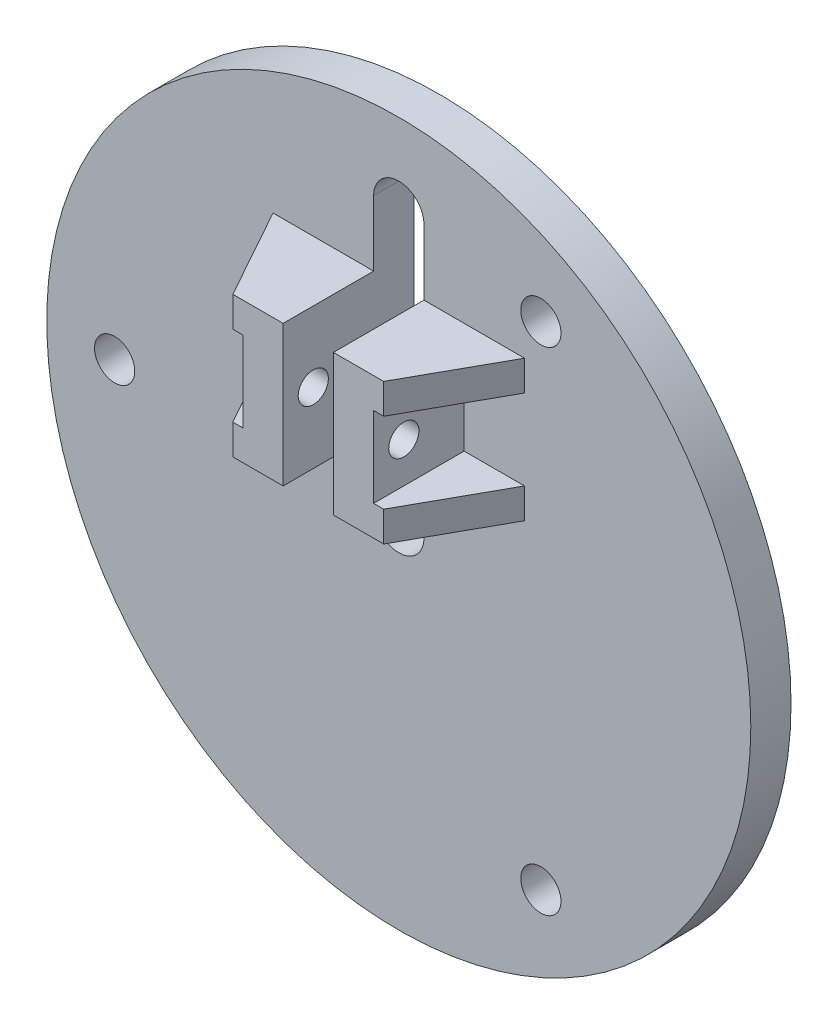
ISO-10303-21;
HEADER;
FILE_DESCRIPTION(('STEP AP214'),'2;1');
FILE_NAME('part.step','',(''),(''),'','','');
FILE_SCHEMA(('AUTOMOTIVE_DESIGN { 1 0 10303 214 1 1 1 1 }'));
ENDSEC;
DATA;
#1=APPLICATION_CONTEXT('core data for automotive mechanical design processes');
#2=APPLICATION_PROTOCOL_DEFINITION('international standard','automotive_design',2000,#1);
#3=PRODUCT_CONTEXT('',#1,'mechanical');
#4=PRODUCT('Part','Part','',(#3));
#5=PRODUCT_RELATED_PRODUCT_CATEGORY('part','',(#4));
#6=PRODUCT_DEFINITION_FORMATION('','',#4);
#7=PRODUCT_DEFINITION_CONTEXT('part definition',#1,'design');
#8=PRODUCT_DEFINITION('design','',#6,#7);
#9=PRODUCT_DEFINITION_SHAPE('','',#8);
#10=(LENGTH_UNIT() NAMED_UNIT(*) SI_UNIT(.MILLI.,.METRE.));
#11=(NAMED_UNIT(*) PLANE_ANGLE_UNIT() SI_UNIT($,.RADIAN.));
#12=(NAMED_UNIT(*) SI_UNIT($,.STERADIAN.) SOLID_ANGLE_UNIT());
#13=UNCERTAINTY_MEASURE_WITH_UNIT(LENGTH_MEASURE(1.E-05),#10,'distance_accuracy_value','');
#14=(GEOMETRIC_REPRESENTATION_CONTEXT(3) GLOBAL_UNCERTAINTY_ASSIGNED_CONTEXT((#13)) GLOBAL_UNIT_ASSIGNED_CONTEXT((#10,
#11,#12)) REPRESENTATION_CONTEXT('',''));
#15=CARTESIAN_POINT('',(0.,0.,0.));
#16=DIRECTION('',(0.,0.,1.));
#17=DIRECTION('',(1.,0.,0.));
#18=AXIS2_PLACEMENT_3D('',#15,#16,#17);
#19=CARTESIAN_POINT('',(0.,0.,4.));
#20=DIRECTION('',(0.,0.,1.));
#21=DIRECTION('',(1.,0.,0.));
#22=AXIS2_PLACEMENT_3D('',#19,#20,#21);
#23=PLANE('',#22);
#24=DIRECTION('',(0.,1.,0.));
#25=VECTOR('',#24,1.);
#26=CARTESIAN_POINT('',(12.5,20.5,4.));
#27=LINE('',#26,#25);
#28=CARTESIAN_POINT('',(12.5,17.5,4.));
#29=VERTEX_POINT('',#28);
#30=CARTESIAN_POINT('',(12.5,20.5,4.));
#31=VERTEX_POINT('',#30);
#32=EDGE_CURVE('E201',#29,#31,#27,.T.);
#33=ORIENTED_EDGE('',*,*,#32,.F.);
#34=DIRECTION('',(1.,0.,0.));
#35=VECTOR('',#34,1.);
#36=CARTESIAN_POINT('',(12.5,17.5,4.));
#37=LINE('',#36,#35);
#38=CARTESIAN_POINT('',(6.5,17.5,4.));
#39=VERTEX_POINT('',#38);
#40=EDGE_CURVE('E198',#39,#29,#37,.T.);
#41=ORIENTED_EDGE('',*,*,#40,.F.);
#42=DIRECTION('',(0.,1.,0.));
#43=VECTOR('',#42,1.);
#44=CARTESIAN_POINT('',(6.5,17.5,4.));
#45=LINE('',#44,#43);
#46=CARTESIAN_POINT('',(6.5,9.5,4.));
#47=VERTEX_POINT('',#46);
#48=EDGE_CURVE('E193',#47,#39,#45,.T.);
#49=ORIENTED_EDGE('',*,*,#48,.F.);
#50=DIRECTION('',(-1.,0.,0.));
#51=VECTOR('',#50,1.);
#52=CARTESIAN_POINT('',(6.5,9.5,4.));
#53=LINE('',#52,#51);
#54=CARTESIAN_POINT('',(12.5,9.5,4.));
#55=VERTEX_POINT('',#54);
#56=EDGE_CURVE('E191',#55,#47,#53,.T.);
#57=ORIENTED_EDGE('',*,*,#56,.F.);
#58=DIRECTION('',(0.,1.,0.));
#59=VECTOR('',#58,1.);
#60=CARTESIAN_POINT('',(12.5,9.5,4.));
#61=LINE('',#60,#59);
#62=CARTESIAN_POINT('',(12.5,6.5,4.));
#63=VERTEX_POINT('',#62);
#64=EDGE_CURVE('E170',#63,#55,#61,.T.);
#65=ORIENTED_EDGE('',*,*,#64,.F.);
#66=DIRECTION('',(1.,0.,0.));
#67=VECTOR('',#66,1.);
#68=CARTESIAN_POINT('',(12.5,6.5,4.));
#69=LINE('',#68,#67);
#70=CARTESIAN_POINT('',(2.5,6.5,4.));
#71=VERTEX_POINT('',#70);
#72=EDGE_CURVE('E178',#71,#63,#69,.T.);
#73=ORIENTED_EDGE('',*,*,#72,.F.);
#74=DIRECTION('',(0.,1.,0.));
#75=VECTOR('',#74,1.);
#76=CARTESIAN_POINT('',(2.5,0.,4.));
#77=LINE('',#76,#75);
#78=CARTESIAN_POINT('',(2.5,0.,4.));
#79=VERTEX_POINT('',#78);
#80=EDGE_CURVE('E323',#79,#71,#77,.T.);
#81=ORIENTED_EDGE('',*,*,#80,.F.);
#82=CARTESIAN_POINT('',(0.,0.,4.));
#83=DIRECTION('',(0.,0.,1.));
#84=DIRECTION('',(1.,0.,0.));
#85=AXIS2_PLACEMENT_3D('',#82,#83,#84);
#86=CIRCLE('',#85,2.5);
#87=CARTESIAN_POINT('',(-2.5,0.,4.));
#88=VERTEX_POINT('',#87);
#89=EDGE_CURVE('E301',#88,#79,#86,.T.);
#90=ORIENTED_EDGE('',*,*,#89,.F.);
#91=DIRECTION('',(0.,-1.,0.));
#92=VECTOR('',#91,1.);
#93=CARTESIAN_POINT('',(-2.5,0.,4.));
#94=LINE('',#93,#92);
#95=CARTESIAN_POINT('',(-2.5,6.5,4.));
#96=VERTEX_POINT('',#95);
#97=EDGE_CURVE('E280',#96,#88,#94,.T.);
#98=ORIENTED_EDGE('',*,*,#97,.F.);
#99=DIRECTION('',(1.,0.,0.));
#100=VECTOR('',#99,1.);
#101=CARTESIAN_POINT('',(-12.5,6.5,4.));
#102=LINE('',#101,#100);
#103=CARTESIAN_POINT('',(-12.5,6.5,4.));
#104=VERTEX_POINT('',#103);
#105=EDGE_CURVE('E221',#104,#96,#102,.T.);
#106=ORIENTED_EDGE('',*,*,#105,.F.);
#107=DIRECTION('',(0.,-1.,0.));
#108=VECTOR('',#107,1.);
#109=CARTESIAN_POINT('',(-12.5,9.5,4.));
#110=LINE('',#109,#108);
#111=CARTESIAN_POINT('',(-12.5,9.5,4.));
#112=VERTEX_POINT('',#111);
#113=EDGE_CURVE('E245',#112,#104,#110,.T.);
#114=ORIENTED_EDGE('',*,*,#113,.F.);
#115=DIRECTION('',(-1.,0.,0.));
#116=VECTOR('',#115,1.);
#117=CARTESIAN_POINT('',(-6.5,9.5,4.));
#118=LINE('',#117,#116);
#119=CARTESIAN_POINT('',(-6.5,9.5,4.));
#120=VERTEX_POINT('',#119);
#121=EDGE_CURVE('E242',#120,#112,#118,.T.);
#122=ORIENTED_EDGE('',*,*,#121,.F.);
#123=DIRECTION('',(0.,-1.,0.));
#124=VECTOR('',#123,1.);
#125=CARTESIAN_POINT('',(-6.5,17.5,4.));
#126=LINE('',#125,#124);
#127=CARTESIAN_POINT('',(-6.5,17.5,4.));
#128=VERTEX_POINT('',#127);
#129=EDGE_CURVE('E239',#128,#120,#126,.T.);
#130=ORIENTED_EDGE('',*,*,#129,.F.);
#131=DIRECTION('',(1.,0.,0.));
#132=VECTOR('',#131,1.);
#133=CARTESIAN_POINT('',(-12.5,17.5,4.));
#134=LINE('',#133,#132);
#135=CARTESIAN_POINT('',(-12.5,17.5,4.));
#136=VERTEX_POINT('',#135);
#137=EDGE_CURVE('E236',#136,#128,#134,.T.);
#138=ORIENTED_EDGE('',*,*,#137,.F.);
#139=DIRECTION('',(0.,-1.,0.));
#140=VECTOR('',#139,1.);
#141=CARTESIAN_POINT('',(-12.5,20.5,4.));
#142=LINE('',#141,#140);
#143=CARTESIAN_POINT('',(-12.5,20.5,4.));
#144=VERTEX_POINT('',#143);
#145=EDGE_CURVE('E234',#144,#136,#142,.T.);
#146=ORIENTED_EDGE('',*,*,#145,.F.);
#147=DIRECTION('',(-1.,0.,0.));
#148=VECTOR('',#147,1.);
#149=CARTESIAN_POINT('',(-2.5,20.5,4.));
#150=LINE('',#149,#148);
#151=CARTESIAN_POINT('',(-2.5,20.5,4.));
#152=VERTEX_POINT('',#151);
#153=EDGE_CURVE('E217',#152,#144,#150,.T.);
#154=ORIENTED_EDGE('',*,*,#153,.F.);
#155=CARTESIAN_POINT('',(-2.5,27.,4.));
#156=VERTEX_POINT('',#155);
#157=EDGE_CURVE('E275',#156,#152,#94,.T.);
#158=ORIENTED_EDGE('',*,*,#157,.F.);
#159=CARTESIAN_POINT('',(0.,27.,4.));
#160=DIRECTION('',(0.,0.,1.));
#161=DIRECTION('',(1.,0.,0.));
#162=AXIS2_PLACEMENT_3D('',#159,#160,#161);
#163=CIRCLE('',#162,2.5);
#164=CARTESIAN_POINT('',(2.5,27.,4.));
#165=VERTEX_POINT('',#164);
#166=EDGE_CURVE('E285',#165,#156,#163,.T.);
#167=ORIENTED_EDGE('',*,*,#166,.F.);
#168=CARTESIAN_POINT('',(2.5,20.5,4.));
#169=VERTEX_POINT('',#168);
#170=EDGE_CURVE('E324',#169,#165,#77,.T.);
#171=ORIENTED_EDGE('',*,*,#170,.F.);
#172=DIRECTION('',(-1.,0.,0.));
#173=VECTOR('',#172,1.);
#174=CARTESIAN_POINT('',(2.5,20.5,4.));
#175=LINE('',#174,#173);
#176=EDGE_CURVE('E203',#31,#169,#175,.T.);
#177=ORIENTED_EDGE('',*,*,#176,.F.);
#178=EDGE_LOOP('',(#33,#41,#49,#57,#65,#73,#81,#90,#98,#106,#114,#122,#130,#138,#146,#154,#158,
#167,#171,#177));
#179=FACE_BOUND('',#178,.T.);
#180=CARTESIAN_POINT('',(14.125,-24.4652176569104,4.));
#181=DIRECTION('',(0.,0.,1.));
#182=DIRECTION('',(1.,0.,0.));
#183=AXIS2_PLACEMENT_3D('',#180,#181,#182);
#184=CIRCLE('',#183,2.00000000000001);
#185=CARTESIAN_POINT('',(16.125,-24.4652176569104,4.));
#186=VERTEX_POINT('',#185);
#187=EDGE_CURVE('E347',#186,#186,#184,.T.);
#188=ORIENTED_EDGE('',*,*,#187,.F.);
#189=EDGE_LOOP('',(#188));
#190=FACE_BOUND('',#189,.T.);
#191=CARTESIAN_POINT('',(14.125,24.4652176569104,4.));
#192=DIRECTION('',(0.,0.,1.));
#193=DIRECTION('',(1.,0.,0.));
#194=AXIS2_PLACEMENT_3D('',#191,#192,#193);
#195=CIRCLE('',#194,2.00000000000001);
#196=CARTESIAN_POINT('',(16.125,24.4652176569104,4.));
#197=VERTEX_POINT('',#196);
#198=EDGE_CURVE('E292',#197,#197,#195,.T.);
#199=ORIENTED_EDGE('',*,*,#198,.F.);
#200=EDGE_LOOP('',(#199));
#201=FACE_BOUND('',#200,.T.);
#202=CARTESIAN_POINT('',(0.,0.,4.));
#203=DIRECTION('',(0.,0.,1.));
#204=DIRECTION('',(1.,0.,0.));
#205=AXIS2_PLACEMENT_3D('',#202,#203,#204);
#206=CIRCLE('',#205,35.);
#207=CARTESIAN_POINT('',(35.,0.,4.));
#208=VERTEX_POINT('',#207);
#209=EDGE_CURVE('E260',#208,#208,#206,.T.);
#210=ORIENTED_EDGE('',*,*,#209,.T.);
#211=EDGE_LOOP('',(#210));
#212=FACE_BOUND('',#211,.T.);
#213=CARTESIAN_POINT('',(-28.25,0.,4.));
#214=DIRECTION('',(0.,0.,1.));
#215=DIRECTION('',(1.,0.,0.));
#216=AXIS2_PLACEMENT_3D('',#213,#214,#215);
#217=CIRCLE('',#216,2.);
#218=CARTESIAN_POINT('',(-26.25,0.,4.));
#219=VERTEX_POINT('',#218);
#220=EDGE_CURVE('E360',#219,#219,#217,.T.);
#221=ORIENTED_EDGE('',*,*,#220,.F.);
#222=EDGE_LOOP('',(#221));
#223=FACE_BOUND('',#222,.T.);
#224=ADVANCED_FACE('F32',(#179,#190,#201,#212,#223),#23,.T.);
#225=CARTESIAN_POINT('',(0.,0.,0.));
#226=DIRECTION('',(0.,0.,1.));
#227=DIRECTION('',(1.,0.,0.));
#228=AXIS2_PLACEMENT_3D('',#225,#226,#227);
#229=PLANE('',#228);
#230=CARTESIAN_POINT('',(-28.25,0.,0.));
#231=DIRECTION('',(0.,0.,1.));
#232=DIRECTION('',(1.,0.,0.));
#233=AXIS2_PLACEMENT_3D('',#230,#231,#232);
#234=CIRCLE('',#233,2.);
#235=CARTESIAN_POINT('',(-26.25,0.,0.));
#236=VERTEX_POINT('',#235);
#237=EDGE_CURVE('E358',#236,#236,#234,.T.);
#238=ORIENTED_EDGE('',*,*,#237,.T.);
#239=EDGE_LOOP('',(#238));
#240=FACE_BOUND('',#239,.T.);
#241=CARTESIAN_POINT('',(0.,0.,0.));
#242=DIRECTION('',(0.,0.,1.));
#243=DIRECTION('',(1.,0.,0.));
#244=AXIS2_PLACEMENT_3D('',#241,#242,#243);
#245=CIRCLE('',#244,2.5);
#246=CARTESIAN_POINT('',(-2.5,0.,0.));
#247=VERTEX_POINT('',#246);
#248=CARTESIAN_POINT('',(2.5,0.,0.));
#249=VERTEX_POINT('',#248);
#250=EDGE_CURVE('E287',#247,#249,#245,.T.);
#251=ORIENTED_EDGE('',*,*,#250,.T.);
#252=DIRECTION('',(0.,1.,0.));
#253=VECTOR('',#252,1.);
#254=CARTESIAN_POINT('',(2.5,0.,0.));
#255=LINE('',#254,#253);
#256=CARTESIAN_POINT('',(2.5,27.,0.));
#257=VERTEX_POINT('',#256);
#258=EDGE_CURVE('E291',#249,#257,#255,.T.);
#259=ORIENTED_EDGE('',*,*,#258,.T.);
#260=CARTESIAN_POINT('',(0.,27.,0.));
#261=DIRECTION('',(0.,0.,1.));
#262=DIRECTION('',(1.,0.,0.));
#263=AXIS2_PLACEMENT_3D('',#260,#261,#262);
#264=CIRCLE('',#263,2.5);
#265=CARTESIAN_POINT('',(-2.5,27.,0.));
#266=VERTEX_POINT('',#265);
#267=EDGE_CURVE('E295',#257,#266,#264,.T.);
#268=ORIENTED_EDGE('',*,*,#267,.T.);
#269=DIRECTION('',(0.,-1.,0.));
#270=VECTOR('',#269,1.);
#271=CARTESIAN_POINT('',(-2.5,0.,0.));
#272=LINE('',#271,#270);
#273=EDGE_CURVE('E298',#266,#247,#272,.T.);
#274=ORIENTED_EDGE('',*,*,#273,.T.);
#275=EDGE_LOOP('',(#251,#259,#268,#274));
#276=FACE_BOUND('',#275,.T.);
#277=CARTESIAN_POINT('',(0.,0.,0.));
#278=DIRECTION('',(0.,0.,1.));
#279=DIRECTION('',(1.,0.,0.));
#280=AXIS2_PLACEMENT_3D('',#277,#278,#279);
#281=CIRCLE('',#280,35.);
#282=CARTESIAN_POINT('',(35.,0.,0.));
#283=VERTEX_POINT('',#282);
#284=EDGE_CURVE('E265',#283,#283,#281,.T.);
#285=ORIENTED_EDGE('',*,*,#284,.F.);
#286=EDGE_LOOP('',(#285));
#287=FACE_BOUND('',#286,.T.);
#288=CARTESIAN_POINT('',(14.125,24.4652176569104,0.));
#289=DIRECTION('',(0.,0.,1.));
#290=DIRECTION('',(1.,0.,0.));
#291=AXIS2_PLACEMENT_3D('',#288,#289,#290);
#292=CIRCLE('',#291,2.00000000000001);
#293=CARTESIAN_POINT('',(16.125,24.4652176569104,0.));
#294=VERTEX_POINT('',#293);
#295=EDGE_CURVE('E327',#294,#294,#292,.T.);
#296=ORIENTED_EDGE('',*,*,#295,.T.);
#297=EDGE_LOOP('',(#296));
#298=FACE_BOUND('',#297,.T.);
#299=CARTESIAN_POINT('',(14.125,-24.4652176569104,0.));
#300=DIRECTION('',(0.,0.,1.));
#301=DIRECTION('',(1.,0.,0.));
#302=AXIS2_PLACEMENT_3D('',#299,#300,#301);
#303=CIRCLE('',#302,2.00000000000001);
#304=CARTESIAN_POINT('',(16.125,-24.4652176569104,0.));
#305=VERTEX_POINT('',#304);
#306=EDGE_CURVE('E344',#305,#305,#303,.T.);
#307=ORIENTED_EDGE('',*,*,#306,.T.);
#308=EDGE_LOOP('',(#307));
#309=FACE_BOUND('',#308,.T.);
#310=ADVANCED_FACE('F316',(#240,#276,#287,#298,#309),#229,.F.);
#311=CARTESIAN_POINT('',(0.,0.,4.));
#312=DIRECTION('',(0.,0.,-1.));
#313=DIRECTION('',(-1.,0.,0.));
#314=AXIS2_PLACEMENT_3D('',#311,#312,#313);
#315=CYLINDRICAL_SURFACE('',#314,35.);
#316=ORIENTED_EDGE('',*,*,#209,.F.);
#317=EDGE_LOOP('',(#316));
#318=FACE_BOUND('',#317,.T.);
#319=ORIENTED_EDGE('',*,*,#284,.T.);
#320=EDGE_LOOP('',(#319));
#321=FACE_BOUND('',#320,.T.);
#322=ADVANCED_FACE('F34',(#318,#321),#315,.T.);
#323=CARTESIAN_POINT('',(0.,0.,4.));
#324=DIRECTION('',(0.,0.,-1.));
#325=DIRECTION('',(-1.,0.,0.));
#326=AXIS2_PLACEMENT_3D('',#323,#324,#325);
#327=CYLINDRICAL_SURFACE('',#326,2.5);
#328=ORIENTED_EDGE('',*,*,#250,.F.);
#329=DIRECTION('',(0.,0.,-1.));
#330=VECTOR('',#329,1.);
#331=CARTESIAN_POINT('',(-2.5,0.,4.));
#332=LINE('',#331,#330);
#333=EDGE_CURVE('E279',#88,#247,#332,.T.);
#334=ORIENTED_EDGE('',*,*,#333,.F.);
#335=ORIENTED_EDGE('',*,*,#89,.T.);
#336=DIRECTION('',(0.,0.,-1.));
#337=VECTOR('',#336,1.);
#338=CARTESIAN_POINT('',(2.5,0.,4.));
#339=LINE('',#338,#337);
#340=EDGE_CURVE('E270',#79,#249,#339,.T.);
#341=ORIENTED_EDGE('',*,*,#340,.T.);
#342=EDGE_LOOP('',(#328,#334,#335,#341));
#343=FACE_BOUND('',#342,.T.);
#344=ADVANCED_FACE('F312',(#343),#327,.F.);
#345=CARTESIAN_POINT('',(2.5,0.,4.));
#346=DIRECTION('',(-1.,0.,0.));
#347=DIRECTION('',(0.,-1.,0.));
#348=AXIS2_PLACEMENT_3D('',#345,#346,#347);
#349=PLANE('',#348);
#350=CARTESIAN_POINT('',(2.5,13.5,10.));
#351=DIRECTION('',(-1.,0.,0.));
#352=DIRECTION('',(0.,-1.,0.));
#353=AXIS2_PLACEMENT_3D('',#350,#351,#352);
#354=CIRCLE('',#353,1.5);
#355=CARTESIAN_POINT('',(2.5,12.,10.));
#356=VERTEX_POINT('',#355);
#357=EDGE_CURVE('E175',#356,#356,#354,.T.);
#358=ORIENTED_EDGE('',*,*,#357,.F.);
#359=EDGE_LOOP('',(#358));
#360=FACE_BOUND('',#359,.T.);
#361=ORIENTED_EDGE('',*,*,#258,.F.);
#362=ORIENTED_EDGE('',*,*,#340,.F.);
#363=ORIENTED_EDGE('',*,*,#80,.T.);
#364=DIRECTION('',(0.,0.,-1.));
#365=VECTOR('',#364,1.);
#366=CARTESIAN_POINT('',(2.5,6.5,13.));
#367=LINE('',#366,#365);
#368=CARTESIAN_POINT('',(2.5,6.5,13.));
#369=VERTEX_POINT('',#368);
#370=EDGE_CURVE('E181',#369,#71,#367,.T.);
#371=ORIENTED_EDGE('',*,*,#370,.F.);
#372=DIRECTION('',(0.,-1.,0.));
#373=VECTOR('',#372,1.);
#374=CARTESIAN_POINT('',(2.5,13.5,13.));
#375=LINE('',#374,#373);
#376=CARTESIAN_POINT('',(2.5,20.5,13.));
#377=VERTEX_POINT('',#376);
#378=EDGE_CURVE('E209',#377,#369,#375,.T.);
#379=ORIENTED_EDGE('',*,*,#378,.F.);
#380=DIRECTION('',(0.,0.,-1.));
#381=VECTOR('',#380,1.);
#382=CARTESIAN_POINT('',(2.5,20.5,13.));
#383=LINE('',#382,#381);
#384=EDGE_CURVE('E208',#377,#169,#383,.T.);
#385=ORIENTED_EDGE('',*,*,#384,.T.);
#386=ORIENTED_EDGE('',*,*,#170,.T.);
#387=DIRECTION('',(0.,0.,-1.));
#388=VECTOR('',#387,1.);
#389=CARTESIAN_POINT('',(2.5,27.,4.));
#390=LINE('',#389,#388);
#391=EDGE_CURVE('E305',#165,#257,#390,.T.);
#392=ORIENTED_EDGE('',*,*,#391,.T.);
#393=EDGE_LOOP('',(#361,#362,#363,#371,#379,#385,#386,#392));
#394=FACE_BOUND('',#393,.T.);
#395=ADVANCED_FACE('F394',(#360,#394),#349,.T.);
#396=CARTESIAN_POINT('',(0.,27.,4.));
#397=DIRECTION('',(0.,0.,-1.));
#398=DIRECTION('',(-1.,0.,0.));
#399=AXIS2_PLACEMENT_3D('',#396,#397,#398);
#400=CYLINDRICAL_SURFACE('',#399,2.5);
#401=ORIENTED_EDGE('',*,*,#267,.F.);
#402=ORIENTED_EDGE('',*,*,#391,.F.);
#403=ORIENTED_EDGE('',*,*,#166,.T.);
#404=DIRECTION('',(0.,0.,-1.));
#405=VECTOR('',#404,1.);
#406=CARTESIAN_POINT('',(-2.5,27.,4.));
#407=LINE('',#406,#405);
#408=EDGE_CURVE('E304',#156,#266,#407,.T.);
#409=ORIENTED_EDGE('',*,*,#408,.T.);
#410=EDGE_LOOP('',(#401,#402,#403,#409));
#411=FACE_BOUND('',#410,.T.);
#412=ADVANCED_FACE('F332',(#411),#400,.F.);
#413=CARTESIAN_POINT('',(-2.5,0.,4.));
#414=DIRECTION('',(1.,0.,0.));
#415=DIRECTION('',(0.,1.,0.));
#416=AXIS2_PLACEMENT_3D('',#413,#414,#415);
#417=PLANE('',#416);
#418=CARTESIAN_POINT('',(-2.5,13.5,10.));
#419=DIRECTION('',(1.,0.,0.));
#420=DIRECTION('',(0.,1.,0.));
#421=AXIS2_PLACEMENT_3D('',#418,#419,#420);
#422=CIRCLE('',#421,1.5);
#423=CARTESIAN_POINT('',(-2.5,15.,10.));
#424=VERTEX_POINT('',#423);
#425=EDGE_CURVE('E636',#424,#424,#422,.T.);
#426=ORIENTED_EDGE('',*,*,#425,.F.);
#427=EDGE_LOOP('',(#426));
#428=FACE_BOUND('',#427,.T.);
#429=ORIENTED_EDGE('',*,*,#273,.F.);
#430=ORIENTED_EDGE('',*,*,#408,.F.);
#431=ORIENTED_EDGE('',*,*,#157,.T.);
#432=DIRECTION('',(0.,0.,-1.));
#433=VECTOR('',#432,1.);
#434=CARTESIAN_POINT('',(-2.5,20.5,13.));
#435=LINE('',#434,#433);
#436=CARTESIAN_POINT('',(-2.5,20.5,13.));
#437=VERTEX_POINT('',#436);
#438=EDGE_CURVE('E339',#437,#152,#435,.T.);
#439=ORIENTED_EDGE('',*,*,#438,.F.);
#440=DIRECTION('',(0.,1.,0.));
#441=VECTOR('',#440,1.);
#442=CARTESIAN_POINT('',(-2.5,6.5,13.));
#443=LINE('',#442,#441);
#444=CARTESIAN_POINT('',(-2.5,6.5,13.));
#445=VERTEX_POINT('',#444);
#446=EDGE_CURVE('E218',#445,#437,#443,.T.);
#447=ORIENTED_EDGE('',*,*,#446,.F.);
#448=DIRECTION('',(0.,0.,-1.));
#449=VECTOR('',#448,1.);
#450=CARTESIAN_POINT('',(-2.5,6.5,13.));
#451=LINE('',#450,#449);
#452=EDGE_CURVE('E233',#445,#96,#451,.T.);
#453=ORIENTED_EDGE('',*,*,#452,.T.);
#454=ORIENTED_EDGE('',*,*,#97,.T.);
#455=ORIENTED_EDGE('',*,*,#333,.T.);
#456=EDGE_LOOP('',(#429,#430,#431,#439,#447,#453,#454,#455));
#457=FACE_BOUND('',#456,.T.);
#458=ADVANCED_FACE('F320',(#428,#457),#417,.T.);
#459=CARTESIAN_POINT('',(14.125,24.4652176569104,4.));
#460=DIRECTION('',(0.,0.,-1.));
#461=DIRECTION('',(-1.,0.,0.));
#462=AXIS2_PLACEMENT_3D('',#459,#460,#461);
#463=CYLINDRICAL_SURFACE('',#462,2.00000000000001);
#464=ORIENTED_EDGE('',*,*,#198,.T.);
#465=EDGE_LOOP('',(#464));
#466=FACE_BOUND('',#465,.T.);
#467=ORIENTED_EDGE('',*,*,#295,.F.);
#468=EDGE_LOOP('',(#467));
#469=FACE_BOUND('',#468,.T.);
#470=ADVANCED_FACE('F372',(#466,#469),#463,.F.);
#471=CARTESIAN_POINT('',(-28.25,0.,4.));
#472=DIRECTION('',(0.,0.,-1.));
#473=DIRECTION('',(-1.,0.,0.));
#474=AXIS2_PLACEMENT_3D('',#471,#472,#473);
#475=CYLINDRICAL_SURFACE('',#474,2.);
#476=ORIENTED_EDGE('',*,*,#220,.T.);
#477=EDGE_LOOP('',(#476));
#478=FACE_BOUND('',#477,.T.);
#479=ORIENTED_EDGE('',*,*,#237,.F.);
#480=EDGE_LOOP('',(#479));
#481=FACE_BOUND('',#480,.T.);
#482=ADVANCED_FACE('F374',(#478,#481),#475,.F.);
#483=CARTESIAN_POINT('',(14.125,-24.4652176569104,4.));
#484=DIRECTION('',(0.,0.,-1.));
#485=DIRECTION('',(-1.,0.,0.));
#486=AXIS2_PLACEMENT_3D('',#483,#484,#485);
#487=CYLINDRICAL_SURFACE('',#486,2.00000000000001);
#488=ORIENTED_EDGE('',*,*,#187,.T.);
#489=EDGE_LOOP('',(#488));
#490=FACE_BOUND('',#489,.T.);
#491=ORIENTED_EDGE('',*,*,#306,.F.);
#492=EDGE_LOOP('',(#491));
#493=FACE_BOUND('',#492,.T.);
#494=ADVANCED_FACE('F380',(#490,#493),#487,.F.);
#495=CARTESIAN_POINT('',(-2.5,20.5,13.));
#496=DIRECTION('',(0.,-1.,0.));
#497=DIRECTION('',(0.,0.,-1.));
#498=AXIS2_PLACEMENT_3D('',#495,#496,#497);
#499=PLANE('',#498);
#500=ORIENTED_EDGE('',*,*,#153,.T.);
#501=DIRECTION('',(-0.485642931178632,0.,-0.874157276121538));
#502=VECTOR('',#501,1.);
#503=CARTESIAN_POINT('',(-7.5,20.5,13.));
#504=LINE('',#503,#502);
#505=CARTESIAN_POINT('',(-7.5,20.5,13.));
#506=VERTEX_POINT('',#505);
#507=EDGE_CURVE('E624',#506,#144,#504,.T.);
#508=ORIENTED_EDGE('',*,*,#507,.F.);
#509=DIRECTION('',(-1.,0.,0.));
#510=VECTOR('',#509,1.);
#511=CARTESIAN_POINT('',(-2.5,20.5,13.));
#512=LINE('',#511,#510);
#513=EDGE_CURVE('E220',#437,#506,#512,.T.);
#514=ORIENTED_EDGE('',*,*,#513,.F.);
#515=ORIENTED_EDGE('',*,*,#438,.T.);
#516=EDGE_LOOP('',(#500,#508,#514,#515));
#517=FACE_BOUND('',#516,.T.);
#518=ADVANCED_FACE('F342',(#517),#499,.F.);
#519=CARTESIAN_POINT('',(-12.5,17.5,13.));
#520=DIRECTION('',(0.,1.,0.));
#521=DIRECTION('',(-1.,0.,0.));
#522=AXIS2_PLACEMENT_3D('',#519,#520,#521);
#523=PLANE('',#522);
#524=DIRECTION('',(1.,0.,0.));
#525=VECTOR('',#524,1.);
#526=CARTESIAN_POINT('',(-12.5,17.5,13.));
#527=LINE('',#526,#525);
#528=CARTESIAN_POINT('',(-7.5,17.5,13.));
#529=VERTEX_POINT('',#528);
#530=CARTESIAN_POINT('',(-6.5,17.5,13.));
#531=VERTEX_POINT('',#530);
#532=EDGE_CURVE('E224',#529,#531,#527,.T.);
#533=ORIENTED_EDGE('',*,*,#532,.F.);
#534=DIRECTION('',(-0.485642931178632,0.,-0.874157276121538));
#535=VECTOR('',#534,1.);
#536=CARTESIAN_POINT('',(-8.67924528301887,17.5,10.877358490566));
#537=LINE('',#536,#535);
#538=EDGE_CURVE('E185',#529,#136,#537,.T.);
#539=ORIENTED_EDGE('',*,*,#538,.T.);
#540=ORIENTED_EDGE('',*,*,#137,.T.);
#541=DIRECTION('',(0.,0.,-1.));
#542=VECTOR('',#541,1.);
#543=CARTESIAN_POINT('',(-6.5,17.5,13.));
#544=LINE('',#543,#542);
#545=EDGE_CURVE('E345',#531,#128,#544,.T.);
#546=ORIENTED_EDGE('',*,*,#545,.F.);
#547=EDGE_LOOP('',(#533,#539,#540,#546));
#548=FACE_BOUND('',#547,.T.);
#549=ADVANCED_FACE('F424',(#548),#523,.F.);
#550=CARTESIAN_POINT('',(-6.5,17.5,13.));
#551=DIRECTION('',(1.,0.,0.));
#552=DIRECTION('',(0.,1.,0.));
#553=AXIS2_PLACEMENT_3D('',#550,#551,#552);
#554=PLANE('',#553);
#555=CARTESIAN_POINT('',(-6.5,13.5,10.));
#556=DIRECTION('',(1.,0.,0.));
#557=DIRECTION('',(0.,1.,0.));
#558=AXIS2_PLACEMENT_3D('',#555,#556,#557);
#559=CIRCLE('',#558,1.5);
#560=CARTESIAN_POINT('',(-6.5,15.,10.));
#561=VERTEX_POINT('',#560);
#562=EDGE_CURVE('E638',#561,#561,#559,.F.);
#563=ORIENTED_EDGE('',*,*,#562,.F.);
#564=EDGE_LOOP('',(#563));
#565=FACE_BOUND('',#564,.T.);
#566=ORIENTED_EDGE('',*,*,#129,.T.);
#567=DIRECTION('',(0.,0.,-1.));
#568=VECTOR('',#567,1.);
#569=CARTESIAN_POINT('',(-6.5,9.5,13.));
#570=LINE('',#569,#568);
#571=CARTESIAN_POINT('',(-6.5,9.5,13.));
#572=VERTEX_POINT('',#571);
#573=EDGE_CURVE('E249',#572,#120,#570,.T.);
#574=ORIENTED_EDGE('',*,*,#573,.F.);
#575=DIRECTION('',(0.,-1.,0.));
#576=VECTOR('',#575,1.);
#577=CARTESIAN_POINT('',(-6.5,17.5,13.));
#578=LINE('',#577,#576);
#579=EDGE_CURVE('E226',#531,#572,#578,.T.);
#580=ORIENTED_EDGE('',*,*,#579,.F.);
#581=ORIENTED_EDGE('',*,*,#545,.T.);
#582=EDGE_LOOP('',(#566,#574,#580,#581));
#583=FACE_BOUND('',#582,.T.);
#584=ADVANCED_FACE('F418',(#565,#583),#554,.F.);
#585=CARTESIAN_POINT('',(-6.5,9.5,13.));
#586=DIRECTION('',(0.,-1.,0.));
#587=DIRECTION('',(0.,0.,-1.));
#588=AXIS2_PLACEMENT_3D('',#585,#586,#587);
#589=PLANE('',#588);
#590=ORIENTED_EDGE('',*,*,#121,.T.);
#591=DIRECTION('',(0.485642931178632,0.,0.874157276121538));
#592=VECTOR('',#591,1.);
#593=CARTESIAN_POINT('',(-7.26415094339623,9.5,13.4245283018868));
#594=LINE('',#593,#592);
#595=CARTESIAN_POINT('',(-7.5,9.5,13.));
#596=VERTEX_POINT('',#595);
#597=EDGE_CURVE('E622',#112,#596,#594,.T.);
#598=ORIENTED_EDGE('',*,*,#597,.T.);
#599=DIRECTION('',(-1.,0.,0.));
#600=VECTOR('',#599,1.);
#601=CARTESIAN_POINT('',(-6.5,9.5,13.));
#602=LINE('',#601,#600);
#603=EDGE_CURVE('E228',#572,#596,#602,.T.);
#604=ORIENTED_EDGE('',*,*,#603,.F.);
#605=ORIENTED_EDGE('',*,*,#573,.T.);
#606=EDGE_LOOP('',(#590,#598,#604,#605));
#607=FACE_BOUND('',#606,.T.);
#608=ADVANCED_FACE('F423',(#607),#589,.F.);
#609=CARTESIAN_POINT('',(-12.5,6.5,13.));
#610=DIRECTION('',(0.,1.,0.));
#611=DIRECTION('',(0.,0.,1.));
#612=AXIS2_PLACEMENT_3D('',#609,#610,#611);
#613=PLANE('',#612);
#614=DIRECTION('',(1.,0.,0.));
#615=VECTOR('',#614,1.);
#616=CARTESIAN_POINT('',(-12.5,6.5,13.));
#617=LINE('',#616,#615);
#618=CARTESIAN_POINT('',(-7.5,6.5,13.));
#619=VERTEX_POINT('',#618);
#620=EDGE_CURVE('E231',#619,#445,#617,.T.);
#621=ORIENTED_EDGE('',*,*,#620,.F.);
#622=DIRECTION('',(0.485642931178632,0.,0.874157276121538));
#623=VECTOR('',#622,1.);
#624=CARTESIAN_POINT('',(-7.5,6.5,13.));
#625=LINE('',#624,#623);
#626=EDGE_CURVE('E628',#104,#619,#625,.T.);
#627=ORIENTED_EDGE('',*,*,#626,.F.);
#628=ORIENTED_EDGE('',*,*,#105,.T.);
#629=ORIENTED_EDGE('',*,*,#452,.F.);
#630=EDGE_LOOP('',(#621,#627,#628,#629));
#631=FACE_BOUND('',#630,.T.);
#632=ADVANCED_FACE('F497',(#631),#613,.F.);
#633=CARTESIAN_POINT('',(-2.5,20.5,13.));
#634=DIRECTION('',(0.,0.,1.));
#635=DIRECTION('',(1.,0.,0.));
#636=AXIS2_PLACEMENT_3D('',#633,#634,#635);
#637=PLANE('',#636);
#638=DIRECTION('',(0.,1.,0.));
#639=VECTOR('',#638,1.);
#640=CARTESIAN_POINT('',(-7.5,20.5,13.));
#641=LINE('',#640,#639);
#642=EDGE_CURVE('E40',#619,#596,#641,.T.);
#643=ORIENTED_EDGE('',*,*,#642,.F.);
#644=ORIENTED_EDGE('',*,*,#620,.T.);
#645=ORIENTED_EDGE('',*,*,#446,.T.);
#646=ORIENTED_EDGE('',*,*,#513,.T.);
#647=DIRECTION('',(0.,-1.,0.));
#648=VECTOR('',#647,1.);
#649=CARTESIAN_POINT('',(-7.5,30.795630140987,13.));
#650=LINE('',#649,#648);
#651=EDGE_CURVE('E625',#506,#529,#650,.T.);
#652=ORIENTED_EDGE('',*,*,#651,.T.);
#653=ORIENTED_EDGE('',*,*,#532,.T.);
#654=ORIENTED_EDGE('',*,*,#579,.T.);
#655=ORIENTED_EDGE('',*,*,#603,.T.);
#656=EDGE_LOOP('',(#643,#644,#645,#646,#652,#653,#654,#655));
#657=FACE_BOUND('',#656,.T.);
#658=ADVANCED_FACE('F494',(#657),#637,.T.);
#659=CARTESIAN_POINT('',(12.5,6.5,13.));
#660=DIRECTION('',(0.,1.,0.));
#661=DIRECTION('',(0.,0.,1.));
#662=AXIS2_PLACEMENT_3D('',#659,#660,#661);
#663=PLANE('',#662);
#664=ORIENTED_EDGE('',*,*,#72,.T.);
#665=DIRECTION('',(0.485642931178632,0.,-0.874157276121538));
#666=VECTOR('',#665,1.);
#667=CARTESIAN_POINT('',(7.5,6.5,13.));
#668=LINE('',#667,#666);
#669=CARTESIAN_POINT('',(7.5,6.5,13.));
#670=VERTEX_POINT('',#669);
#671=EDGE_CURVE('E166',#670,#63,#668,.T.);
#672=ORIENTED_EDGE('',*,*,#671,.F.);
#673=DIRECTION('',(1.,0.,0.));
#674=VECTOR('',#673,1.);
#675=CARTESIAN_POINT('',(12.5,6.5,13.));
#676=LINE('',#675,#674);
#677=EDGE_CURVE('E206',#369,#670,#676,.T.);
#678=ORIENTED_EDGE('',*,*,#677,.F.);
#679=ORIENTED_EDGE('',*,*,#370,.T.);
#680=EDGE_LOOP('',(#664,#672,#678,#679));
#681=FACE_BOUND('',#680,.T.);
#682=ADVANCED_FACE('F179',(#681),#663,.F.);
#683=CARTESIAN_POINT('',(6.5,9.5,13.));
#684=DIRECTION('',(0.,-1.,0.));
#685=DIRECTION('',(0.,0.,-1.));
#686=AXIS2_PLACEMENT_3D('',#683,#684,#685);
#687=PLANE('',#686);
#688=DIRECTION('',(-1.,0.,0.));
#689=VECTOR('',#688,1.);
#690=CARTESIAN_POINT('',(6.5,9.5,13.));
#691=LINE('',#690,#689);
#692=CARTESIAN_POINT('',(7.5,9.5,13.));
#693=VERTEX_POINT('',#692);
#694=CARTESIAN_POINT('',(6.5,9.5,13.));
#695=VERTEX_POINT('',#694);
#696=EDGE_CURVE('E617',#693,#695,#691,.T.);
#697=ORIENTED_EDGE('',*,*,#696,.F.);
#698=DIRECTION('',(0.485642931178632,0.,-0.874157276121538));
#699=VECTOR('',#698,1.);
#700=CARTESIAN_POINT('',(7.26415094339623,9.5,13.4245283018868));
#701=LINE('',#700,#699);
#702=EDGE_CURVE('E55',#693,#55,#701,.T.);
#703=ORIENTED_EDGE('',*,*,#702,.T.);
#704=ORIENTED_EDGE('',*,*,#56,.T.);
#705=DIRECTION('',(0.,0.,-1.));
#706=VECTOR('',#705,1.);
#707=CARTESIAN_POINT('',(6.5,9.5,13.));
#708=LINE('',#707,#706);
#709=EDGE_CURVE('E214',#695,#47,#708,.T.);
#710=ORIENTED_EDGE('',*,*,#709,.F.);
#711=EDGE_LOOP('',(#697,#703,#704,#710));
#712=FACE_BOUND('',#711,.T.);
#713=ADVANCED_FACE('F440',(#712),#687,.F.);
#714=CARTESIAN_POINT('',(6.5,17.5,13.));
#715=DIRECTION('',(-1.,0.,0.));
#716=DIRECTION('',(0.,-1.,0.));
#717=AXIS2_PLACEMENT_3D('',#714,#715,#716);
#718=PLANE('',#717);
#719=CARTESIAN_POINT('',(6.5,13.5,10.));
#720=DIRECTION('',(1.,0.,0.));
#721=DIRECTION('',(0.,1.,0.));
#722=AXIS2_PLACEMENT_3D('',#719,#720,#721);
#723=CIRCLE('',#722,1.5);
#724=CARTESIAN_POINT('',(6.5,15.,10.));
#725=VERTEX_POINT('',#724);
#726=EDGE_CURVE('E641',#725,#725,#723,.T.);
#727=ORIENTED_EDGE('',*,*,#726,.F.);
#728=EDGE_LOOP('',(#727));
#729=FACE_BOUND('',#728,.T.);
#730=ORIENTED_EDGE('',*,*,#48,.T.);
#731=DIRECTION('',(0.,0.,-1.));
#732=VECTOR('',#731,1.);
#733=CARTESIAN_POINT('',(6.5,17.5,13.));
#734=LINE('',#733,#732);
#735=CARTESIAN_POINT('',(6.5,17.5,13.));
#736=VERTEX_POINT('',#735);
#737=EDGE_CURVE('E211',#736,#39,#734,.T.);
#738=ORIENTED_EDGE('',*,*,#737,.F.);
#739=DIRECTION('',(0.,1.,0.));
#740=VECTOR('',#739,1.);
#741=CARTESIAN_POINT('',(6.5,17.5,13.));
#742=LINE('',#741,#740);
#743=EDGE_CURVE('E615',#695,#736,#742,.T.);
#744=ORIENTED_EDGE('',*,*,#743,.F.);
#745=ORIENTED_EDGE('',*,*,#709,.T.);
#746=EDGE_LOOP('',(#730,#738,#744,#745));
#747=FACE_BOUND('',#746,.T.);
#748=ADVANCED_FACE('F434',(#729,#747),#718,.F.);
#749=CARTESIAN_POINT('',(12.5,17.5,13.));
#750=DIRECTION('',(0.,1.,0.));
#751=DIRECTION('',(-1.,0.,0.));
#752=AXIS2_PLACEMENT_3D('',#749,#750,#751);
#753=PLANE('',#752);
#754=ORIENTED_EDGE('',*,*,#40,.T.);
#755=DIRECTION('',(-0.485642931178632,0.,0.874157276121538));
#756=VECTOR('',#755,1.);
#757=CARTESIAN_POINT('',(8.67924528301887,17.5,10.877358490566));
#758=LINE('',#757,#756);
#759=CARTESIAN_POINT('',(7.5,17.5,13.));
#760=VERTEX_POINT('',#759);
#761=EDGE_CURVE('E602',#29,#760,#758,.T.);
#762=ORIENTED_EDGE('',*,*,#761,.T.);
#763=DIRECTION('',(1.,0.,0.));
#764=VECTOR('',#763,1.);
#765=CARTESIAN_POINT('',(12.5,17.5,13.));
#766=LINE('',#765,#764);
#767=EDGE_CURVE('E610',#736,#760,#766,.T.);
#768=ORIENTED_EDGE('',*,*,#767,.F.);
#769=ORIENTED_EDGE('',*,*,#737,.T.);
#770=EDGE_LOOP('',(#754,#762,#768,#769));
#771=FACE_BOUND('',#770,.T.);
#772=ADVANCED_FACE('F439',(#771),#753,.F.);
#773=CARTESIAN_POINT('',(2.5,20.5,13.));
#774=DIRECTION('',(0.,-1.,0.));
#775=DIRECTION('',(0.,0.,-1.));
#776=AXIS2_PLACEMENT_3D('',#773,#774,#775);
#777=PLANE('',#776);
#778=DIRECTION('',(-1.,0.,0.));
#779=VECTOR('',#778,1.);
#780=CARTESIAN_POINT('',(2.5,20.5,13.));
#781=LINE('',#780,#779);
#782=CARTESIAN_POINT('',(7.5,20.5,13.));
#783=VERTEX_POINT('',#782);
#784=EDGE_CURVE('E607',#783,#377,#781,.T.);
#785=ORIENTED_EDGE('',*,*,#784,.F.);
#786=DIRECTION('',(-0.485642931178632,0.,0.874157276121538));
#787=VECTOR('',#786,1.);
#788=CARTESIAN_POINT('',(7.5,20.5,13.));
#789=LINE('',#788,#787);
#790=EDGE_CURVE('E47',#31,#783,#789,.T.);
#791=ORIENTED_EDGE('',*,*,#790,.F.);
#792=ORIENTED_EDGE('',*,*,#176,.T.);
#793=ORIENTED_EDGE('',*,*,#384,.F.);
#794=EDGE_LOOP('',(#785,#791,#792,#793));
#795=FACE_BOUND('',#794,.T.);
#796=ADVANCED_FACE('F483',(#795),#777,.F.);
#797=CARTESIAN_POINT('',(2.5,6.5,13.));
#798=DIRECTION('',(0.,0.,-1.));
#799=DIRECTION('',(-1.,0.,0.));
#800=AXIS2_PLACEMENT_3D('',#797,#798,#799);
#801=PLANE('',#800);
#802=ORIENTED_EDGE('',*,*,#677,.T.);
#803=DIRECTION('',(0.,1.,0.));
#804=VECTOR('',#803,1.);
#805=CARTESIAN_POINT('',(7.5,6.5,13.));
#806=LINE('',#805,#804);
#807=EDGE_CURVE('E11',#670,#693,#806,.T.);
#808=ORIENTED_EDGE('',*,*,#807,.T.);
#809=ORIENTED_EDGE('',*,*,#696,.T.);
#810=ORIENTED_EDGE('',*,*,#743,.T.);
#811=ORIENTED_EDGE('',*,*,#767,.T.);
#812=DIRECTION('',(0.,-1.,0.));
#813=VECTOR('',#812,1.);
#814=CARTESIAN_POINT('',(7.5,30.795630140987,13.));
#815=LINE('',#814,#813);
#816=EDGE_CURVE('E174',#783,#760,#815,.T.);
#817=ORIENTED_EDGE('',*,*,#816,.F.);
#818=ORIENTED_EDGE('',*,*,#784,.T.);
#819=ORIENTED_EDGE('',*,*,#378,.T.);
#820=EDGE_LOOP('',(#802,#808,#809,#810,#811,#817,#818,#819));
#821=FACE_BOUND('',#820,.T.);
#822=ADVANCED_FACE('F479',(#821),#801,.F.);
#823=CARTESIAN_POINT('',(-7.5,30.795630140987,13.));
#824=DIRECTION('',(0.874157276121538,0.,-0.485642931178632));
#825=DIRECTION('',(-0.485642931178632,0.,-0.874157276121538));
#826=AXIS2_PLACEMENT_3D('',#823,#824,#825);
#827=PLANE('',#826);
#828=ORIENTED_EDGE('',*,*,#651,.F.);
#829=ORIENTED_EDGE('',*,*,#507,.T.);
#830=ORIENTED_EDGE('',*,*,#145,.T.);
#831=ORIENTED_EDGE('',*,*,#538,.F.);
#832=EDGE_LOOP('',(#828,#829,#830,#831));
#833=FACE_BOUND('',#832,.T.);
#834=ADVANCED_FACE('F475',(#833),#827,.F.);
#835=ORIENTED_EDGE('',*,*,#113,.T.);
#836=ORIENTED_EDGE('',*,*,#626,.T.);
#837=ORIENTED_EDGE('',*,*,#642,.T.);
#838=ORIENTED_EDGE('',*,*,#597,.F.);
#839=EDGE_LOOP('',(#835,#836,#837,#838));
#840=FACE_BOUND('',#839,.T.);
#841=ADVANCED_FACE('F478',(#840),#827,.F.);
#842=CARTESIAN_POINT('',(7.5,30.795630140987,13.));
#843=DIRECTION('',(-0.874157276121538,0.,-0.485642931178632));
#844=DIRECTION('',(-0.485642931178632,0.,0.874157276121538));
#845=AXIS2_PLACEMENT_3D('',#842,#843,#844);
#846=PLANE('',#845);
#847=ORIENTED_EDGE('',*,*,#32,.T.);
#848=ORIENTED_EDGE('',*,*,#790,.T.);
#849=ORIENTED_EDGE('',*,*,#816,.T.);
#850=ORIENTED_EDGE('',*,*,#761,.F.);
#851=EDGE_LOOP('',(#847,#848,#849,#850));
#852=FACE_BOUND('',#851,.T.);
#853=ADVANCED_FACE('F474',(#852),#846,.F.);
#854=ORIENTED_EDGE('',*,*,#807,.F.);
#855=ORIENTED_EDGE('',*,*,#671,.T.);
#856=ORIENTED_EDGE('',*,*,#64,.T.);
#857=ORIENTED_EDGE('',*,*,#702,.F.);
#858=EDGE_LOOP('',(#854,#855,#856,#857));
#859=FACE_BOUND('',#858,.T.);
#860=ADVANCED_FACE('F168',(#859),#846,.F.);
#861=CARTESIAN_POINT('',(-10.7426406871193,13.5,10.));
#862=DIRECTION('',(1.,0.,0.));
#863=DIRECTION('',(0.,1.,0.));
#864=AXIS2_PLACEMENT_3D('',#861,#862,#863);
#865=CYLINDRICAL_SURFACE('',#864,1.5);
#866=ORIENTED_EDGE('',*,*,#357,.T.);
#867=EDGE_LOOP('',(#866));
#868=FACE_BOUND('',#867,.T.);
#869=ORIENTED_EDGE('',*,*,#726,.T.);
#870=EDGE_LOOP('',(#869));
#871=FACE_BOUND('',#870,.T.);
#872=ADVANCED_FACE('F450',(#868,#871),#865,.F.);
#873=ORIENTED_EDGE('',*,*,#425,.T.);
#874=EDGE_LOOP('',(#873));
#875=FACE_BOUND('',#874,.T.);
#876=ORIENTED_EDGE('',*,*,#562,.T.);
#877=EDGE_LOOP('',(#876));
#878=FACE_BOUND('',#877,.T.);
#879=ADVANCED_FACE('F455',(#875,#878),#865,.F.);
#880=CLOSED_SHELL('',(#224,#310,#322,#344,#395,#412,#458,#470,#482,#494,#518,#549,#584,#608,
#632,#658,#682,#713,#748,#772,#796,#822,#834,#841,#853,#860,#872,#879));
#881=MANIFOLD_SOLID_BREP('B2',#880);
#882=ADVANCED_BREP_SHAPE_REPRESENTATION('',(#18,#881),#14);
#883=SHAPE_DEFINITION_REPRESENTATION(#9,#882);
ENDSEC;
END-ISO-10303-21;
